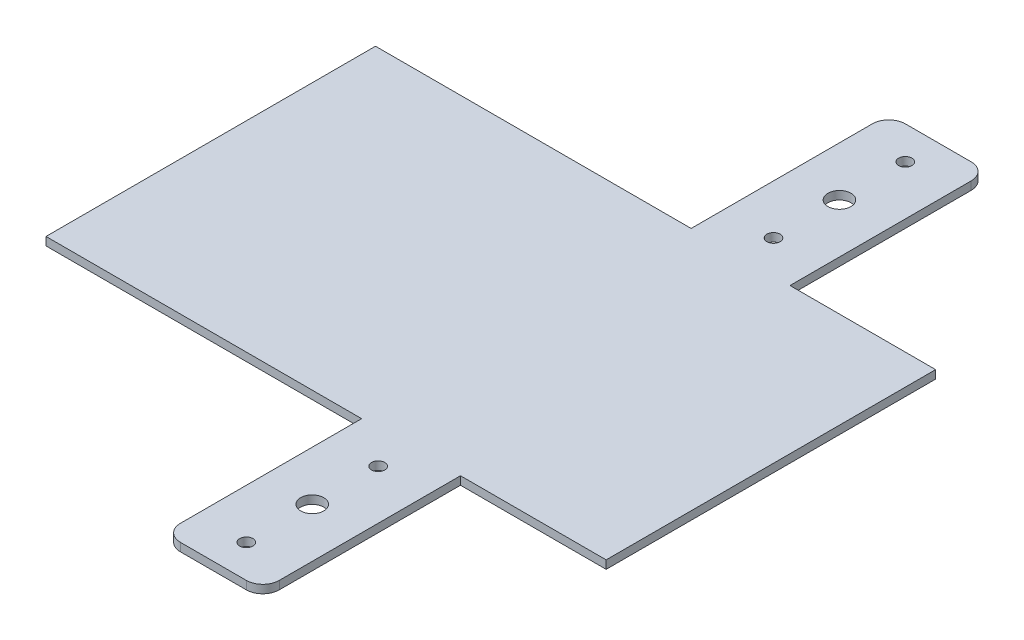
ISO-10303-21;
HEADER;
FILE_DESCRIPTION(('STEP AP214'),'2;1');
FILE_NAME('part.step','',(''),(''),'','','');
FILE_SCHEMA(('AUTOMOTIVE_DESIGN { 1 0 10303 214 1 1 1 1 }'));
ENDSEC;
DATA;
#1=APPLICATION_CONTEXT('core data for automotive mechanical design processes');
#2=APPLICATION_PROTOCOL_DEFINITION('international standard','automotive_design',2000,#1);
#3=PRODUCT_CONTEXT('',#1,'mechanical');
#4=PRODUCT('Part','Part','',(#3));
#5=PRODUCT_RELATED_PRODUCT_CATEGORY('part','',(#4));
#6=PRODUCT_DEFINITION_FORMATION('','',#4);
#7=PRODUCT_DEFINITION_CONTEXT('part definition',#1,'design');
#8=PRODUCT_DEFINITION('design','',#6,#7);
#9=PRODUCT_DEFINITION_SHAPE('','',#8);
#10=(LENGTH_UNIT() NAMED_UNIT(*) SI_UNIT(.MILLI.,.METRE.));
#11=(NAMED_UNIT(*) PLANE_ANGLE_UNIT() SI_UNIT($,.RADIAN.));
#12=(NAMED_UNIT(*) SI_UNIT($,.STERADIAN.) SOLID_ANGLE_UNIT());
#13=UNCERTAINTY_MEASURE_WITH_UNIT(LENGTH_MEASURE(1.E-05),#10,'distance_accuracy_value','');
#14=(GEOMETRIC_REPRESENTATION_CONTEXT(3) GLOBAL_UNCERTAINTY_ASSIGNED_CONTEXT((#13)) GLOBAL_UNIT_ASSIGNED_CONTEXT((#10,
#11,#12)) REPRESENTATION_CONTEXT('',''));
#15=CARTESIAN_POINT('',(0.,0.,0.));
#16=DIRECTION('',(0.,0.,1.));
#17=DIRECTION('',(1.,0.,0.));
#18=AXIS2_PLACEMENT_3D('',#15,#16,#17);
#19=CARTESIAN_POINT('',(-499.708642175763,5.,-105.631578947368));
#20=DIRECTION('',(0.,1.,0.));
#21=DIRECTION('',(0.,0.,1.));
#22=AXIS2_PLACEMENT_3D('',#19,#20,#21);
#23=PLANE('',#22);
#24=CARTESIAN_POINT('',(-479.708642175763,5.,-115.631578947368));
#25=DIRECTION('',(0.,1.,0.));
#26=DIRECTION('',(0.,0.,1.));
#27=AXIS2_PLACEMENT_3D('',#24,#25,#26);
#28=CIRCLE('',#27,3.99999999999999);
#29=CARTESIAN_POINT('',(-479.708642175763,5.,-111.631578947368));
#30=VERTEX_POINT('',#29);
#31=EDGE_CURVE('E412',#30,#30,#28,.T.);
#32=ORIENTED_EDGE('',*,*,#31,.F.);
#33=EDGE_LOOP('',(#32));
#34=FACE_BOUND('',#33,.T.);
#35=CARTESIAN_POINT('',(-479.708642175763,5.,-515.631578947368));
#36=DIRECTION('',(0.,1.,0.));
#37=DIRECTION('',(0.,0.,-1.));
#38=AXIS2_PLACEMENT_3D('',#35,#36,#37);
#39=CIRCLE('',#38,3.99999999999999);
#40=CARTESIAN_POINT('',(-479.708642175763,5.,-519.631578947368));
#41=VERTEX_POINT('',#40);
#42=EDGE_CURVE('E404',#41,#41,#39,.T.);
#43=ORIENTED_EDGE('',*,*,#42,.F.);
#44=EDGE_LOOP('',(#43));
#45=FACE_BOUND('',#44,.T.);
#46=CARTESIAN_POINT('',(-479.708642175763,5.,-435.631578947368));
#47=DIRECTION('',(0.,1.,0.));
#48=DIRECTION('',(0.,0.,-1.));
#49=AXIS2_PLACEMENT_3D('',#46,#47,#48);
#50=CIRCLE('',#49,3.99999999999999);
#51=CARTESIAN_POINT('',(-479.708642175763,5.,-439.631578947368));
#52=VERTEX_POINT('',#51);
#53=EDGE_CURVE('E399',#52,#52,#50,.T.);
#54=ORIENTED_EDGE('',*,*,#53,.F.);
#55=EDGE_LOOP('',(#54));
#56=FACE_BOUND('',#55,.T.);
#57=CARTESIAN_POINT('',(-479.708642175763,5.,-195.631578947368));
#58=DIRECTION('',(0.,1.,0.));
#59=DIRECTION('',(0.,0.,1.));
#60=AXIS2_PLACEMENT_3D('',#57,#58,#59);
#61=CIRCLE('',#60,3.99999999999999);
#62=CARTESIAN_POINT('',(-479.708642175763,5.,-191.631578947368));
#63=VERTEX_POINT('',#62);
#64=EDGE_CURVE('E411',#63,#63,#61,.T.);
#65=ORIENTED_EDGE('',*,*,#64,.F.);
#66=EDGE_LOOP('',(#65));
#67=FACE_BOUND('',#66,.T.);
#68=CARTESIAN_POINT('',(-479.708642175763,5.,-475.631578947368));
#69=DIRECTION('',(0.,1.,0.));
#70=DIRECTION('',(0.,0.,1.));
#71=AXIS2_PLACEMENT_3D('',#68,#69,#70);
#72=CIRCLE('',#71,6.99999999999999);
#73=CARTESIAN_POINT('',(-479.708642175763,5.,-468.631578947368));
#74=VERTEX_POINT('',#73);
#75=EDGE_CURVE('E196',#74,#74,#72,.T.);
#76=ORIENTED_EDGE('',*,*,#75,.F.);
#77=EDGE_LOOP('',(#76));
#78=FACE_BOUND('',#77,.T.);
#79=DIRECTION('',(0.,0.,1.));
#80=VECTOR('',#79,1.);
#81=CARTESIAN_POINT('',(-701.29647542446,5.,-415.631578947368));
#82=LINE('',#81,#80);
#83=CARTESIAN_POINT('',(-701.29647542446,5.,-415.631578947368));
#84=VERTEX_POINT('',#83);
#85=CARTESIAN_POINT('',(-701.29647542446,5.,-215.631578947368));
#86=VERTEX_POINT('',#85);
#87=EDGE_CURVE('E238',#84,#86,#82,.T.);
#88=ORIENTED_EDGE('',*,*,#87,.T.);
#89=DIRECTION('',(1.,0.,0.));
#90=VECTOR('',#89,1.);
#91=CARTESIAN_POINT('',(-701.29647542446,5.,-215.631578947368));
#92=LINE('',#91,#90);
#93=CARTESIAN_POINT('',(-509.708642175763,5.,-215.631578947368));
#94=VERTEX_POINT('',#93);
#95=EDGE_CURVE('E126',#86,#94,#92,.T.);
#96=ORIENTED_EDGE('',*,*,#95,.T.);
#97=DIRECTION('',(0.,0.,1.));
#98=VECTOR('',#97,1.);
#99=CARTESIAN_POINT('',(-509.708642175763,5.,-215.631578947368));
#100=LINE('',#99,#98);
#101=CARTESIAN_POINT('',(-509.708642175763,5.,-105.631578947368));
#102=VERTEX_POINT('',#101);
#103=EDGE_CURVE('E291',#94,#102,#100,.T.);
#104=ORIENTED_EDGE('',*,*,#103,.T.);
#105=CARTESIAN_POINT('',(-499.708642175763,5.,-105.631578947368));
#106=DIRECTION('',(0.,1.,0.));
#107=DIRECTION('',(0.,0.,1.));
#108=AXIS2_PLACEMENT_3D('',#105,#106,#107);
#109=CIRCLE('',#108,10.);
#110=CARTESIAN_POINT('',(-499.708642175763,5.,-95.6315789473683));
#111=VERTEX_POINT('',#110);
#112=EDGE_CURVE('E311',#102,#111,#109,.T.);
#113=ORIENTED_EDGE('',*,*,#112,.T.);
#114=DIRECTION('',(1.,0.,0.));
#115=VECTOR('',#114,1.);
#116=CARTESIAN_POINT('',(-499.708642175763,5.,-95.6315789473683));
#117=LINE('',#116,#115);
#118=CARTESIAN_POINT('',(-459.708642175763,5.,-95.6315789473684));
#119=VERTEX_POINT('',#118);
#120=EDGE_CURVE('E307',#111,#119,#117,.T.);
#121=ORIENTED_EDGE('',*,*,#120,.T.);
#122=CARTESIAN_POINT('',(-459.708642175763,5.,-105.631578947368));
#123=DIRECTION('',(0.,1.,0.));
#124=DIRECTION('',(0.,0.,1.));
#125=AXIS2_PLACEMENT_3D('',#122,#123,#124);
#126=CIRCLE('',#125,10.);
#127=CARTESIAN_POINT('',(-449.708642175763,5.,-105.631578947368));
#128=VERTEX_POINT('',#127);
#129=EDGE_CURVE('E310',#119,#128,#126,.T.);
#130=ORIENTED_EDGE('',*,*,#129,.T.);
#131=DIRECTION('',(0.,0.,-1.));
#132=VECTOR('',#131,1.);
#133=CARTESIAN_POINT('',(-449.708642175763,5.,-215.631578947368));
#134=LINE('',#133,#132);
#135=CARTESIAN_POINT('',(-449.708642175763,5.,-215.631578947368));
#136=VERTEX_POINT('',#135);
#137=EDGE_CURVE('E315',#128,#136,#134,.T.);
#138=ORIENTED_EDGE('',*,*,#137,.T.);
#139=DIRECTION('',(1.,0.,0.));
#140=VECTOR('',#139,1.);
#141=CARTESIAN_POINT('',(-449.708642175763,5.,-215.631578947368));
#142=LINE('',#141,#140);
#143=CARTESIAN_POINT('',(-361.29647542446,5.,-215.631578947368));
#144=VERTEX_POINT('',#143);
#145=EDGE_CURVE('E322',#136,#144,#142,.T.);
#146=ORIENTED_EDGE('',*,*,#145,.T.);
#147=DIRECTION('',(0.,0.,-1.));
#148=VECTOR('',#147,1.);
#149=CARTESIAN_POINT('',(-361.29647542446,5.,-415.631578947368));
#150=LINE('',#149,#148);
#151=CARTESIAN_POINT('',(-361.29647542446,5.,-415.631578947368));
#152=VERTEX_POINT('',#151);
#153=EDGE_CURVE('E325',#144,#152,#150,.T.);
#154=ORIENTED_EDGE('',*,*,#153,.T.);
#155=DIRECTION('',(-1.,0.,0.));
#156=VECTOR('',#155,1.);
#157=CARTESIAN_POINT('',(-449.708642175763,5.,-415.631578947368));
#158=LINE('',#157,#156);
#159=CARTESIAN_POINT('',(-449.708642175763,5.,-415.631578947368));
#160=VERTEX_POINT('',#159);
#161=EDGE_CURVE('E328',#152,#160,#158,.T.);
#162=ORIENTED_EDGE('',*,*,#161,.T.);
#163=DIRECTION('',(0.,0.,-1.));
#164=VECTOR('',#163,1.);
#165=CARTESIAN_POINT('',(-449.708642175763,5.,-415.631578947368));
#166=LINE('',#165,#164);
#167=CARTESIAN_POINT('',(-449.708642175763,5.,-525.631578947368));
#168=VERTEX_POINT('',#167);
#169=EDGE_CURVE('E331',#160,#168,#166,.T.);
#170=ORIENTED_EDGE('',*,*,#169,.T.);
#171=CARTESIAN_POINT('',(-459.708642175763,5.,-525.631578947368));
#172=DIRECTION('',(0.,1.,0.));
#173=DIRECTION('',(0.,0.,-1.));
#174=AXIS2_PLACEMENT_3D('',#171,#172,#173);
#175=CIRCLE('',#174,10.);
#176=CARTESIAN_POINT('',(-459.708642175763,5.,-535.631578947368));
#177=VERTEX_POINT('',#176);
#178=EDGE_CURVE('E334',#168,#177,#175,.T.);
#179=ORIENTED_EDGE('',*,*,#178,.T.);
#180=DIRECTION('',(-1.,0.,0.));
#181=VECTOR('',#180,1.);
#182=CARTESIAN_POINT('',(-499.708642175763,5.,-535.631578947368));
#183=LINE('',#182,#181);
#184=CARTESIAN_POINT('',(-499.708642175763,5.,-535.631578947368));
#185=VERTEX_POINT('',#184);
#186=EDGE_CURVE('E169',#177,#185,#183,.T.);
#187=ORIENTED_EDGE('',*,*,#186,.T.);
#188=CARTESIAN_POINT('',(-499.708642175763,5.,-525.631578947368));
#189=DIRECTION('',(0.,1.,0.));
#190=DIRECTION('',(0.,0.,-1.));
#191=AXIS2_PLACEMENT_3D('',#188,#189,#190);
#192=CIRCLE('',#191,10.);
#193=CARTESIAN_POINT('',(-509.708642175763,5.,-525.631578947368));
#194=VERTEX_POINT('',#193);
#195=EDGE_CURVE('E163',#185,#194,#192,.T.);
#196=ORIENTED_EDGE('',*,*,#195,.T.);
#197=DIRECTION('',(0.,0.,1.));
#198=VECTOR('',#197,1.);
#199=CARTESIAN_POINT('',(-509.708642175763,5.,-415.631578947368));
#200=LINE('',#199,#198);
#201=CARTESIAN_POINT('',(-509.708642175763,5.,-415.631578947368));
#202=VERTEX_POINT('',#201);
#203=EDGE_CURVE('E167',#194,#202,#200,.T.);
#204=ORIENTED_EDGE('',*,*,#203,.T.);
#205=DIRECTION('',(-1.,0.,0.));
#206=VECTOR('',#205,1.);
#207=CARTESIAN_POINT('',(-701.29647542446,5.,-415.631578947368));
#208=LINE('',#207,#206);
#209=EDGE_CURVE('E59',#202,#84,#208,.T.);
#210=ORIENTED_EDGE('',*,*,#209,.T.);
#211=EDGE_LOOP('',(#88,#96,#104,#113,#121,#130,#138,#146,#154,#162,#170,#179,#187,#196,#204,#210));
#212=FACE_BOUND('',#211,.T.);
#213=CARTESIAN_POINT('',(-479.708642175763,5.,-155.631578947368));
#214=DIRECTION('',(0.,1.,0.));
#215=DIRECTION('',(0.,0.,1.));
#216=AXIS2_PLACEMENT_3D('',#213,#214,#215);
#217=CIRCLE('',#216,6.99999999999999);
#218=CARTESIAN_POINT('',(-479.708642175763,5.,-148.631578947368));
#219=VERTEX_POINT('',#218);
#220=EDGE_CURVE('E431',#219,#219,#217,.T.);
#221=ORIENTED_EDGE('',*,*,#220,.F.);
#222=EDGE_LOOP('',(#221));
#223=FACE_BOUND('',#222,.T.);
#224=ADVANCED_FACE('F41',(#34,#45,#56,#67,#78,#212,#223),#23,.T.);
#225=CARTESIAN_POINT('',(-499.708642175763,0.,-105.631578947368));
#226=DIRECTION('',(0.,1.,0.));
#227=DIRECTION('',(0.,0.,1.));
#228=AXIS2_PLACEMENT_3D('',#225,#226,#227);
#229=PLANE('',#228);
#230=CARTESIAN_POINT('',(-479.708642175763,0.,-115.631578947368));
#231=DIRECTION('',(0.,1.,0.));
#232=DIRECTION('',(0.,0.,1.));
#233=AXIS2_PLACEMENT_3D('',#230,#231,#232);
#234=CIRCLE('',#233,3.99999999999999);
#235=CARTESIAN_POINT('',(-479.708642175763,0.,-111.631578947368));
#236=VERTEX_POINT('',#235);
#237=EDGE_CURVE('E407',#236,#236,#234,.T.);
#238=ORIENTED_EDGE('',*,*,#237,.T.);
#239=EDGE_LOOP('',(#238));
#240=FACE_BOUND('',#239,.T.);
#241=CARTESIAN_POINT('',(-479.708642175763,0.,-515.631578947368));
#242=DIRECTION('',(0.,1.,0.));
#243=DIRECTION('',(0.,0.,-1.));
#244=AXIS2_PLACEMENT_3D('',#241,#242,#243);
#245=CIRCLE('',#244,3.99999999999999);
#246=CARTESIAN_POINT('',(-479.708642175763,0.,-519.631578947368));
#247=VERTEX_POINT('',#246);
#248=EDGE_CURVE('E416',#247,#247,#245,.T.);
#249=ORIENTED_EDGE('',*,*,#248,.T.);
#250=EDGE_LOOP('',(#249));
#251=FACE_BOUND('',#250,.T.);
#252=CARTESIAN_POINT('',(-479.708642175763,0.,-435.631578947368));
#253=DIRECTION('',(0.,1.,0.));
#254=DIRECTION('',(0.,0.,-1.));
#255=AXIS2_PLACEMENT_3D('',#252,#253,#254);
#256=CIRCLE('',#255,3.99999999999999);
#257=CARTESIAN_POINT('',(-479.708642175763,0.,-439.631578947368));
#258=VERTEX_POINT('',#257);
#259=EDGE_CURVE('E396',#258,#258,#256,.T.);
#260=ORIENTED_EDGE('',*,*,#259,.T.);
#261=EDGE_LOOP('',(#260));
#262=FACE_BOUND('',#261,.T.);
#263=CARTESIAN_POINT('',(-479.708642175763,0.,-195.631578947368));
#264=DIRECTION('',(0.,1.,0.));
#265=DIRECTION('',(0.,0.,1.));
#266=AXIS2_PLACEMENT_3D('',#263,#264,#265);
#267=CIRCLE('',#266,3.99999999999999);
#268=CARTESIAN_POINT('',(-479.708642175763,0.,-191.631578947368));
#269=VERTEX_POINT('',#268);
#270=EDGE_CURVE('E423',#269,#269,#267,.T.);
#271=ORIENTED_EDGE('',*,*,#270,.T.);
#272=EDGE_LOOP('',(#271));
#273=FACE_BOUND('',#272,.T.);
#274=DIRECTION('',(0.,0.,1.));
#275=VECTOR('',#274,1.);
#276=CARTESIAN_POINT('',(-701.29647542446,0.,-415.631578947368));
#277=LINE('',#276,#275);
#278=CARTESIAN_POINT('',(-701.29647542446,0.,-415.631578947368));
#279=VERTEX_POINT('',#278);
#280=CARTESIAN_POINT('',(-701.29647542446,0.,-215.631578947368));
#281=VERTEX_POINT('',#280);
#282=EDGE_CURVE('E191',#279,#281,#277,.T.);
#283=ORIENTED_EDGE('',*,*,#282,.F.);
#284=DIRECTION('',(-1.,0.,0.));
#285=VECTOR('',#284,1.);
#286=CARTESIAN_POINT('',(-701.29647542446,0.,-415.631578947368));
#287=LINE('',#286,#285);
#288=CARTESIAN_POINT('',(-509.708642175763,0.,-415.631578947368));
#289=VERTEX_POINT('',#288);
#290=EDGE_CURVE('E118',#289,#279,#287,.T.);
#291=ORIENTED_EDGE('',*,*,#290,.F.);
#292=DIRECTION('',(0.,0.,1.));
#293=VECTOR('',#292,1.);
#294=CARTESIAN_POINT('',(-509.708642175763,0.,-415.631578947368));
#295=LINE('',#294,#293);
#296=CARTESIAN_POINT('',(-509.708642175763,0.,-525.631578947368));
#297=VERTEX_POINT('',#296);
#298=EDGE_CURVE('E112',#297,#289,#295,.T.);
#299=ORIENTED_EDGE('',*,*,#298,.F.);
#300=CARTESIAN_POINT('',(-499.708642175763,0.,-525.631578947368));
#301=DIRECTION('',(0.,1.,0.));
#302=DIRECTION('',(0.,0.,-1.));
#303=AXIS2_PLACEMENT_3D('',#300,#301,#302);
#304=CIRCLE('',#303,10.);
#305=CARTESIAN_POINT('',(-499.708642175763,0.,-535.631578947368));
#306=VERTEX_POINT('',#305);
#307=EDGE_CURVE('E178',#306,#297,#304,.T.);
#308=ORIENTED_EDGE('',*,*,#307,.F.);
#309=DIRECTION('',(-1.,0.,0.));
#310=VECTOR('',#309,1.);
#311=CARTESIAN_POINT('',(-499.708642175763,0.,-535.631578947368));
#312=LINE('',#311,#310);
#313=CARTESIAN_POINT('',(-459.708642175763,0.,-535.631578947368));
#314=VERTEX_POINT('',#313);
#315=EDGE_CURVE('E229',#314,#306,#312,.T.);
#316=ORIENTED_EDGE('',*,*,#315,.F.);
#317=CARTESIAN_POINT('',(-459.708642175763,0.,-525.631578947368));
#318=DIRECTION('',(0.,1.,0.));
#319=DIRECTION('',(0.,0.,-1.));
#320=AXIS2_PLACEMENT_3D('',#317,#318,#319);
#321=CIRCLE('',#320,10.);
#322=CARTESIAN_POINT('',(-449.708642175763,0.,-525.631578947368));
#323=VERTEX_POINT('',#322);
#324=EDGE_CURVE('E226',#323,#314,#321,.T.);
#325=ORIENTED_EDGE('',*,*,#324,.F.);
#326=DIRECTION('',(0.,0.,-1.));
#327=VECTOR('',#326,1.);
#328=CARTESIAN_POINT('',(-449.708642175763,0.,-415.631578947368));
#329=LINE('',#328,#327);
#330=CARTESIAN_POINT('',(-449.708642175763,0.,-415.631578947368));
#331=VERTEX_POINT('',#330);
#332=EDGE_CURVE('E223',#331,#323,#329,.T.);
#333=ORIENTED_EDGE('',*,*,#332,.F.);
#334=DIRECTION('',(-1.,0.,0.));
#335=VECTOR('',#334,1.);
#336=CARTESIAN_POINT('',(-449.708642175763,0.,-415.631578947368));
#337=LINE('',#336,#335);
#338=CARTESIAN_POINT('',(-361.29647542446,0.,-415.631578947368));
#339=VERTEX_POINT('',#338);
#340=EDGE_CURVE('E220',#339,#331,#337,.T.);
#341=ORIENTED_EDGE('',*,*,#340,.F.);
#342=DIRECTION('',(0.,0.,-1.));
#343=VECTOR('',#342,1.);
#344=CARTESIAN_POINT('',(-361.29647542446,0.,-415.631578947368));
#345=LINE('',#344,#343);
#346=CARTESIAN_POINT('',(-361.29647542446,0.,-215.631578947368));
#347=VERTEX_POINT('',#346);
#348=EDGE_CURVE('E217',#347,#339,#345,.T.);
#349=ORIENTED_EDGE('',*,*,#348,.F.);
#350=DIRECTION('',(1.,0.,0.));
#351=VECTOR('',#350,1.);
#352=CARTESIAN_POINT('',(-449.708642175763,0.,-215.631578947368));
#353=LINE('',#352,#351);
#354=CARTESIAN_POINT('',(-449.708642175763,0.,-215.631578947368));
#355=VERTEX_POINT('',#354);
#356=EDGE_CURVE('E214',#355,#347,#353,.T.);
#357=ORIENTED_EDGE('',*,*,#356,.F.);
#358=DIRECTION('',(0.,0.,-1.));
#359=VECTOR('',#358,1.);
#360=CARTESIAN_POINT('',(-449.708642175763,0.,-215.631578947368));
#361=LINE('',#360,#359);
#362=CARTESIAN_POINT('',(-449.708642175763,0.,-105.631578947368));
#363=VERTEX_POINT('',#362);
#364=EDGE_CURVE('E211',#363,#355,#361,.T.);
#365=ORIENTED_EDGE('',*,*,#364,.F.);
#366=CARTESIAN_POINT('',(-459.708642175763,0.,-105.631578947368));
#367=DIRECTION('',(0.,1.,0.));
#368=DIRECTION('',(0.,0.,1.));
#369=AXIS2_PLACEMENT_3D('',#366,#367,#368);
#370=CIRCLE('',#369,10.);
#371=CARTESIAN_POINT('',(-459.708642175763,0.,-95.6315789473684));
#372=VERTEX_POINT('',#371);
#373=EDGE_CURVE('E208',#372,#363,#370,.T.);
#374=ORIENTED_EDGE('',*,*,#373,.F.);
#375=DIRECTION('',(1.,0.,0.));
#376=VECTOR('',#375,1.);
#377=CARTESIAN_POINT('',(-499.708642175763,0.,-95.6315789473683));
#378=LINE('',#377,#376);
#379=CARTESIAN_POINT('',(-499.708642175763,0.,-95.6315789473683));
#380=VERTEX_POINT('',#379);
#381=EDGE_CURVE('E205',#380,#372,#378,.T.);
#382=ORIENTED_EDGE('',*,*,#381,.F.);
#383=CARTESIAN_POINT('',(-499.708642175763,0.,-105.631578947368));
#384=DIRECTION('',(0.,1.,0.));
#385=DIRECTION('',(0.,0.,1.));
#386=AXIS2_PLACEMENT_3D('',#383,#384,#385);
#387=CIRCLE('',#386,10.);
#388=CARTESIAN_POINT('',(-509.708642175763,0.,-105.631578947368));
#389=VERTEX_POINT('',#388);
#390=EDGE_CURVE('E202',#389,#380,#387,.T.);
#391=ORIENTED_EDGE('',*,*,#390,.F.);
#392=DIRECTION('',(0.,0.,1.));
#393=VECTOR('',#392,1.);
#394=CARTESIAN_POINT('',(-509.708642175763,0.,-215.631578947368));
#395=LINE('',#394,#393);
#396=CARTESIAN_POINT('',(-509.708642175763,0.,-215.631578947368));
#397=VERTEX_POINT('',#396);
#398=EDGE_CURVE('E199',#397,#389,#395,.T.);
#399=ORIENTED_EDGE('',*,*,#398,.F.);
#400=DIRECTION('',(1.,0.,0.));
#401=VECTOR('',#400,1.);
#402=CARTESIAN_POINT('',(-701.29647542446,0.,-215.631578947368));
#403=LINE('',#402,#401);
#404=EDGE_CURVE('E195',#281,#397,#403,.T.);
#405=ORIENTED_EDGE('',*,*,#404,.F.);
#406=EDGE_LOOP('',(#283,#291,#299,#308,#316,#325,#333,#341,#349,#357,#365,#374,#382,#391,#399,#405));
#407=FACE_BOUND('',#406,.T.);
#408=CARTESIAN_POINT('',(-479.708642175763,0.,-475.631578947368));
#409=DIRECTION('',(0.,1.,0.));
#410=DIRECTION('',(0.,0.,1.));
#411=AXIS2_PLACEMENT_3D('',#408,#409,#410);
#412=CIRCLE('',#411,6.99999999999999);
#413=CARTESIAN_POINT('',(-479.708642175763,0.,-468.631578947368));
#414=VERTEX_POINT('',#413);
#415=EDGE_CURVE('E435',#414,#414,#412,.T.);
#416=ORIENTED_EDGE('',*,*,#415,.T.);
#417=EDGE_LOOP('',(#416));
#418=FACE_BOUND('',#417,.T.);
#419=CARTESIAN_POINT('',(-479.708642175763,0.,-155.631578947368));
#420=DIRECTION('',(0.,1.,0.));
#421=DIRECTION('',(0.,0.,1.));
#422=AXIS2_PLACEMENT_3D('',#419,#420,#421);
#423=CIRCLE('',#422,6.99999999999999);
#424=CARTESIAN_POINT('',(-479.708642175763,0.,-148.631578947368));
#425=VERTEX_POINT('',#424);
#426=EDGE_CURVE('E427',#425,#425,#423,.T.);
#427=ORIENTED_EDGE('',*,*,#426,.T.);
#428=EDGE_LOOP('',(#427));
#429=FACE_BOUND('',#428,.T.);
#430=ADVANCED_FACE('F295',(#240,#251,#262,#273,#407,#418,#429),#229,.F.);
#431=CARTESIAN_POINT('',(-701.29647542446,5.,-415.631578947368));
#432=DIRECTION('',(1.,0.,0.));
#433=DIRECTION('',(0.,0.,-1.));
#434=AXIS2_PLACEMENT_3D('',#431,#432,#433);
#435=PLANE('',#434);
#436=ORIENTED_EDGE('',*,*,#282,.T.);
#437=DIRECTION('',(0.,-1.,0.));
#438=VECTOR('',#437,1.);
#439=CARTESIAN_POINT('',(-701.29647542446,5.,-215.631578947368));
#440=LINE('',#439,#438);
#441=EDGE_CURVE('E11',#86,#281,#440,.T.);
#442=ORIENTED_EDGE('',*,*,#441,.F.);
#443=ORIENTED_EDGE('',*,*,#87,.F.);
#444=DIRECTION('',(0.,-1.,0.));
#445=VECTOR('',#444,1.);
#446=CARTESIAN_POINT('',(-701.29647542446,5.,-415.631578947368));
#447=LINE('',#446,#445);
#448=EDGE_CURVE('E187',#84,#279,#447,.T.);
#449=ORIENTED_EDGE('',*,*,#448,.T.);
#450=EDGE_LOOP('',(#436,#442,#443,#449));
#451=FACE_BOUND('',#450,.T.);
#452=ADVANCED_FACE('F43',(#451),#435,.F.);
#453=CARTESIAN_POINT('',(-701.29647542446,5.,-215.631578947368));
#454=DIRECTION('',(0.,0.,-1.));
#455=DIRECTION('',(-1.,0.,0.));
#456=AXIS2_PLACEMENT_3D('',#453,#454,#455);
#457=PLANE('',#456);
#458=ORIENTED_EDGE('',*,*,#404,.T.);
#459=DIRECTION('',(0.,-1.,0.));
#460=VECTOR('',#459,1.);
#461=CARTESIAN_POINT('',(-509.708642175763,5.,-215.631578947368));
#462=LINE('',#461,#460);
#463=EDGE_CURVE('E51',#94,#397,#462,.T.);
#464=ORIENTED_EDGE('',*,*,#463,.F.);
#465=ORIENTED_EDGE('',*,*,#95,.F.);
#466=ORIENTED_EDGE('',*,*,#441,.T.);
#467=EDGE_LOOP('',(#458,#464,#465,#466));
#468=FACE_BOUND('',#467,.T.);
#469=ADVANCED_FACE('F606',(#468),#457,.F.);
#470=CARTESIAN_POINT('',(-509.708642175763,5.,-215.631578947368));
#471=DIRECTION('',(1.,0.,0.));
#472=DIRECTION('',(0.,0.,-1.));
#473=AXIS2_PLACEMENT_3D('',#470,#471,#472);
#474=PLANE('',#473);
#475=ORIENTED_EDGE('',*,*,#398,.T.);
#476=DIRECTION('',(0.,-1.,0.));
#477=VECTOR('',#476,1.);
#478=CARTESIAN_POINT('',(-509.708642175763,5.,-105.631578947368));
#479=LINE('',#478,#477);
#480=EDGE_CURVE('E281',#102,#389,#479,.T.);
#481=ORIENTED_EDGE('',*,*,#480,.F.);
#482=ORIENTED_EDGE('',*,*,#103,.F.);
#483=ORIENTED_EDGE('',*,*,#463,.T.);
#484=EDGE_LOOP('',(#475,#481,#482,#483));
#485=FACE_BOUND('',#484,.T.);
#486=ADVANCED_FACE('F289',(#485),#474,.F.);
#487=CARTESIAN_POINT('',(-499.708642175763,5.,-105.631578947368));
#488=DIRECTION('',(0.,-1.,0.));
#489=DIRECTION('',(0.,0.,-1.));
#490=AXIS2_PLACEMENT_3D('',#487,#488,#489);
#491=CYLINDRICAL_SURFACE('',#490,10.);
#492=ORIENTED_EDGE('',*,*,#390,.T.);
#493=DIRECTION('',(0.,-1.,0.));
#494=VECTOR('',#493,1.);
#495=CARTESIAN_POINT('',(-499.708642175763,5.,-95.6315789473683));
#496=LINE('',#495,#494);
#497=EDGE_CURVE('E277',#111,#380,#496,.T.);
#498=ORIENTED_EDGE('',*,*,#497,.F.);
#499=ORIENTED_EDGE('',*,*,#112,.F.);
#500=ORIENTED_EDGE('',*,*,#480,.T.);
#501=EDGE_LOOP('',(#492,#498,#499,#500));
#502=FACE_BOUND('',#501,.T.);
#503=ADVANCED_FACE('F301',(#502),#491,.T.);
#504=CARTESIAN_POINT('',(-499.708642175763,5.,-95.6315789473683));
#505=DIRECTION('',(0.,0.,-1.));
#506=DIRECTION('',(-1.,0.,0.));
#507=AXIS2_PLACEMENT_3D('',#504,#505,#506);
#508=PLANE('',#507);
#509=ORIENTED_EDGE('',*,*,#381,.T.);
#510=DIRECTION('',(0.,-1.,0.));
#511=VECTOR('',#510,1.);
#512=CARTESIAN_POINT('',(-459.708642175763,5.,-95.6315789473684));
#513=LINE('',#512,#511);
#514=EDGE_CURVE('E273',#119,#372,#513,.T.);
#515=ORIENTED_EDGE('',*,*,#514,.F.);
#516=ORIENTED_EDGE('',*,*,#120,.F.);
#517=ORIENTED_EDGE('',*,*,#497,.T.);
#518=EDGE_LOOP('',(#509,#515,#516,#517));
#519=FACE_BOUND('',#518,.T.);
#520=ADVANCED_FACE('F305',(#519),#508,.F.);
#521=CARTESIAN_POINT('',(-459.708642175763,5.,-105.631578947368));
#522=DIRECTION('',(0.,-1.,0.));
#523=DIRECTION('',(0.,0.,-1.));
#524=AXIS2_PLACEMENT_3D('',#521,#522,#523);
#525=CYLINDRICAL_SURFACE('',#524,10.);
#526=ORIENTED_EDGE('',*,*,#373,.T.);
#527=DIRECTION('',(0.,-1.,0.));
#528=VECTOR('',#527,1.);
#529=CARTESIAN_POINT('',(-449.708642175763,5.,-105.631578947368));
#530=LINE('',#529,#528);
#531=EDGE_CURVE('E269',#128,#363,#530,.T.);
#532=ORIENTED_EDGE('',*,*,#531,.F.);
#533=ORIENTED_EDGE('',*,*,#129,.F.);
#534=ORIENTED_EDGE('',*,*,#514,.T.);
#535=EDGE_LOOP('',(#526,#532,#533,#534));
#536=FACE_BOUND('',#535,.T.);
#537=ADVANCED_FACE('F575',(#536),#525,.T.);
#538=CARTESIAN_POINT('',(-449.708642175763,5.,-215.631578947368));
#539=DIRECTION('',(-1.,0.,0.));
#540=DIRECTION('',(0.,0.,1.));
#541=AXIS2_PLACEMENT_3D('',#538,#539,#540);
#542=PLANE('',#541);
#543=ORIENTED_EDGE('',*,*,#364,.T.);
#544=DIRECTION('',(0.,-1.,0.));
#545=VECTOR('',#544,1.);
#546=CARTESIAN_POINT('',(-449.708642175763,5.,-215.631578947368));
#547=LINE('',#546,#545);
#548=EDGE_CURVE('E265',#136,#355,#547,.T.);
#549=ORIENTED_EDGE('',*,*,#548,.F.);
#550=ORIENTED_EDGE('',*,*,#137,.F.);
#551=ORIENTED_EDGE('',*,*,#531,.T.);
#552=EDGE_LOOP('',(#543,#549,#550,#551));
#553=FACE_BOUND('',#552,.T.);
#554=ADVANCED_FACE('F566',(#553),#542,.F.);
#555=CARTESIAN_POINT('',(-449.708642175763,5.,-215.631578947368));
#556=DIRECTION('',(0.,0.,-1.));
#557=DIRECTION('',(-1.,0.,0.));
#558=AXIS2_PLACEMENT_3D('',#555,#556,#557);
#559=PLANE('',#558);
#560=ORIENTED_EDGE('',*,*,#356,.T.);
#561=DIRECTION('',(0.,-1.,0.));
#562=VECTOR('',#561,1.);
#563=CARTESIAN_POINT('',(-361.29647542446,5.,-215.631578947368));
#564=LINE('',#563,#562);
#565=EDGE_CURVE('E261',#144,#347,#564,.T.);
#566=ORIENTED_EDGE('',*,*,#565,.F.);
#567=ORIENTED_EDGE('',*,*,#145,.F.);
#568=ORIENTED_EDGE('',*,*,#548,.T.);
#569=EDGE_LOOP('',(#560,#566,#567,#568));
#570=FACE_BOUND('',#569,.T.);
#571=ADVANCED_FACE('F557',(#570),#559,.F.);
#572=CARTESIAN_POINT('',(-361.29647542446,5.,-415.631578947368));
#573=DIRECTION('',(-1.,0.,0.));
#574=DIRECTION('',(0.,0.,1.));
#575=AXIS2_PLACEMENT_3D('',#572,#573,#574);
#576=PLANE('',#575);
#577=ORIENTED_EDGE('',*,*,#348,.T.);
#578=DIRECTION('',(0.,-1.,0.));
#579=VECTOR('',#578,1.);
#580=CARTESIAN_POINT('',(-361.29647542446,5.,-415.631578947368));
#581=LINE('',#580,#579);
#582=EDGE_CURVE('E257',#152,#339,#581,.T.);
#583=ORIENTED_EDGE('',*,*,#582,.F.);
#584=ORIENTED_EDGE('',*,*,#153,.F.);
#585=ORIENTED_EDGE('',*,*,#565,.T.);
#586=EDGE_LOOP('',(#577,#583,#584,#585));
#587=FACE_BOUND('',#586,.T.);
#588=ADVANCED_FACE('F548',(#587),#576,.F.);
#589=CARTESIAN_POINT('',(-449.708642175763,5.,-415.631578947368));
#590=DIRECTION('',(0.,0.,1.));
#591=DIRECTION('',(1.,0.,0.));
#592=AXIS2_PLACEMENT_3D('',#589,#590,#591);
#593=PLANE('',#592);
#594=ORIENTED_EDGE('',*,*,#340,.T.);
#595=DIRECTION('',(0.,-1.,0.));
#596=VECTOR('',#595,1.);
#597=CARTESIAN_POINT('',(-449.708642175763,5.,-415.631578947368));
#598=LINE('',#597,#596);
#599=EDGE_CURVE('E253',#160,#331,#598,.T.);
#600=ORIENTED_EDGE('',*,*,#599,.F.);
#601=ORIENTED_EDGE('',*,*,#161,.F.);
#602=ORIENTED_EDGE('',*,*,#582,.T.);
#603=EDGE_LOOP('',(#594,#600,#601,#602));
#604=FACE_BOUND('',#603,.T.);
#605=ADVANCED_FACE('F539',(#604),#593,.F.);
#606=CARTESIAN_POINT('',(-449.708642175763,5.,-415.631578947368));
#607=DIRECTION('',(-1.,0.,0.));
#608=DIRECTION('',(0.,0.,1.));
#609=AXIS2_PLACEMENT_3D('',#606,#607,#608);
#610=PLANE('',#609);
#611=ORIENTED_EDGE('',*,*,#332,.T.);
#612=DIRECTION('',(0.,-1.,0.));
#613=VECTOR('',#612,1.);
#614=CARTESIAN_POINT('',(-449.708642175763,5.,-525.631578947368));
#615=LINE('',#614,#613);
#616=EDGE_CURVE('E249',#168,#323,#615,.T.);
#617=ORIENTED_EDGE('',*,*,#616,.F.);
#618=ORIENTED_EDGE('',*,*,#169,.F.);
#619=ORIENTED_EDGE('',*,*,#599,.T.);
#620=EDGE_LOOP('',(#611,#617,#618,#619));
#621=FACE_BOUND('',#620,.T.);
#622=ADVANCED_FACE('F531',(#621),#610,.F.);
#623=CARTESIAN_POINT('',(-459.708642175763,5.,-525.631578947368));
#624=DIRECTION('',(0.,-1.,0.));
#625=DIRECTION('',(0.,0.,-1.));
#626=AXIS2_PLACEMENT_3D('',#623,#624,#625);
#627=CYLINDRICAL_SURFACE('',#626,10.);
#628=ORIENTED_EDGE('',*,*,#324,.T.);
#629=DIRECTION('',(0.,-1.,0.));
#630=VECTOR('',#629,1.);
#631=CARTESIAN_POINT('',(-459.708642175763,5.,-535.631578947368));
#632=LINE('',#631,#630);
#633=EDGE_CURVE('E245',#177,#314,#632,.T.);
#634=ORIENTED_EDGE('',*,*,#633,.F.);
#635=ORIENTED_EDGE('',*,*,#178,.F.);
#636=ORIENTED_EDGE('',*,*,#616,.T.);
#637=EDGE_LOOP('',(#628,#634,#635,#636));
#638=FACE_BOUND('',#637,.T.);
#639=ADVANCED_FACE('F342',(#638),#627,.T.);
#640=CARTESIAN_POINT('',(-499.708642175763,5.,-535.631578947368));
#641=DIRECTION('',(0.,0.,1.));
#642=DIRECTION('',(1.,0.,0.));
#643=AXIS2_PLACEMENT_3D('',#640,#641,#642);
#644=PLANE('',#643);
#645=ORIENTED_EDGE('',*,*,#315,.T.);
#646=DIRECTION('',(0.,-1.,0.));
#647=VECTOR('',#646,1.);
#648=CARTESIAN_POINT('',(-499.708642175763,5.,-535.631578947368));
#649=LINE('',#648,#647);
#650=EDGE_CURVE('E180',#185,#306,#649,.T.);
#651=ORIENTED_EDGE('',*,*,#650,.F.);
#652=ORIENTED_EDGE('',*,*,#186,.F.);
#653=ORIENTED_EDGE('',*,*,#633,.T.);
#654=EDGE_LOOP('',(#645,#651,#652,#653));
#655=FACE_BOUND('',#654,.T.);
#656=ADVANCED_FACE('F346',(#655),#644,.F.);
#657=CARTESIAN_POINT('',(-499.708642175763,5.,-525.631578947368));
#658=DIRECTION('',(0.,-1.,0.));
#659=DIRECTION('',(0.,0.,-1.));
#660=AXIS2_PLACEMENT_3D('',#657,#658,#659);
#661=CYLINDRICAL_SURFACE('',#660,10.);
#662=ORIENTED_EDGE('',*,*,#307,.T.);
#663=DIRECTION('',(0.,-1.,0.));
#664=VECTOR('',#663,1.);
#665=CARTESIAN_POINT('',(-509.708642175763,5.,-525.631578947368));
#666=LINE('',#665,#664);
#667=EDGE_CURVE('E175',#194,#297,#666,.T.);
#668=ORIENTED_EDGE('',*,*,#667,.F.);
#669=ORIENTED_EDGE('',*,*,#195,.F.);
#670=ORIENTED_EDGE('',*,*,#650,.T.);
#671=EDGE_LOOP('',(#662,#668,#669,#670));
#672=FACE_BOUND('',#671,.T.);
#673=ADVANCED_FACE('F176',(#672),#661,.T.);
#674=CARTESIAN_POINT('',(-509.708642175763,5.,-415.631578947368));
#675=DIRECTION('',(1.,0.,0.));
#676=DIRECTION('',(0.,0.,-1.));
#677=AXIS2_PLACEMENT_3D('',#674,#675,#676);
#678=PLANE('',#677);
#679=ORIENTED_EDGE('',*,*,#298,.T.);
#680=DIRECTION('',(0.,-1.,0.));
#681=VECTOR('',#680,1.);
#682=CARTESIAN_POINT('',(-509.708642175763,5.,-415.631578947368));
#683=LINE('',#682,#681);
#684=EDGE_CURVE('E181',#202,#289,#683,.T.);
#685=ORIENTED_EDGE('',*,*,#684,.F.);
#686=ORIENTED_EDGE('',*,*,#203,.F.);
#687=ORIENTED_EDGE('',*,*,#667,.T.);
#688=EDGE_LOOP('',(#679,#685,#686,#687));
#689=FACE_BOUND('',#688,.T.);
#690=ADVANCED_FACE('F183',(#689),#678,.F.);
#691=CARTESIAN_POINT('',(-701.29647542446,5.,-415.631578947368));
#692=DIRECTION('',(0.,0.,1.));
#693=DIRECTION('',(1.,0.,0.));
#694=AXIS2_PLACEMENT_3D('',#691,#692,#693);
#695=PLANE('',#694);
#696=ORIENTED_EDGE('',*,*,#290,.T.);
#697=ORIENTED_EDGE('',*,*,#448,.F.);
#698=ORIENTED_EDGE('',*,*,#209,.F.);
#699=ORIENTED_EDGE('',*,*,#684,.T.);
#700=EDGE_LOOP('',(#696,#697,#698,#699));
#701=FACE_BOUND('',#700,.T.);
#702=ADVANCED_FACE('F350',(#701),#695,.F.);
#703=CARTESIAN_POINT('',(-479.708642175763,5.,-475.631578947368));
#704=DIRECTION('',(0.,-1.,0.));
#705=DIRECTION('',(0.,0.,-1.));
#706=AXIS2_PLACEMENT_3D('',#703,#704,#705);
#707=CYLINDRICAL_SURFACE('',#706,6.99999999999999);
#708=ORIENTED_EDGE('',*,*,#75,.T.);
#709=EDGE_LOOP('',(#708));
#710=FACE_BOUND('',#709,.T.);
#711=ORIENTED_EDGE('',*,*,#415,.F.);
#712=EDGE_LOOP('',(#711));
#713=FACE_BOUND('',#712,.T.);
#714=ADVANCED_FACE('F352',(#710,#713),#707,.F.);
#715=CARTESIAN_POINT('',(-479.708642175763,5.,-155.631578947368));
#716=DIRECTION('',(0.,-1.,0.));
#717=DIRECTION('',(0.,0.,-1.));
#718=AXIS2_PLACEMENT_3D('',#715,#716,#717);
#719=CYLINDRICAL_SURFACE('',#718,6.99999999999999);
#720=ORIENTED_EDGE('',*,*,#220,.T.);
#721=EDGE_LOOP('',(#720));
#722=FACE_BOUND('',#721,.T.);
#723=ORIENTED_EDGE('',*,*,#426,.F.);
#724=EDGE_LOOP('',(#723));
#725=FACE_BOUND('',#724,.T.);
#726=ADVANCED_FACE('F358',(#722,#725),#719,.F.);
#727=CARTESIAN_POINT('',(-479.708642175763,0.,-195.631578947368));
#728=DIRECTION('',(0.,1.,0.));
#729=DIRECTION('',(0.,0.,1.));
#730=AXIS2_PLACEMENT_3D('',#727,#728,#729);
#731=CYLINDRICAL_SURFACE('',#730,3.99999999999999);
#732=ORIENTED_EDGE('',*,*,#270,.F.);
#733=EDGE_LOOP('',(#732));
#734=FACE_BOUND('',#733,.T.);
#735=ORIENTED_EDGE('',*,*,#64,.T.);
#736=EDGE_LOOP('',(#735));
#737=FACE_BOUND('',#736,.T.);
#738=ADVANCED_FACE('F375',(#734,#737),#731,.F.);
#739=CARTESIAN_POINT('',(-479.708642175763,0.,-435.631578947368));
#740=DIRECTION('',(0.,1.,0.));
#741=DIRECTION('',(0.,0.,1.));
#742=AXIS2_PLACEMENT_3D('',#739,#740,#741);
#743=CYLINDRICAL_SURFACE('',#742,3.99999999999999);
#744=ORIENTED_EDGE('',*,*,#259,.F.);
#745=EDGE_LOOP('',(#744));
#746=FACE_BOUND('',#745,.T.);
#747=ORIENTED_EDGE('',*,*,#53,.T.);
#748=EDGE_LOOP('',(#747));
#749=FACE_BOUND('',#748,.T.);
#750=ADVANCED_FACE('F379',(#746,#749),#743,.F.);
#751=CARTESIAN_POINT('',(-479.708642175763,0.,-515.631578947368));
#752=DIRECTION('',(0.,1.,0.));
#753=DIRECTION('',(0.,0.,1.));
#754=AXIS2_PLACEMENT_3D('',#751,#752,#753);
#755=CYLINDRICAL_SURFACE('',#754,3.99999999999999);
#756=ORIENTED_EDGE('',*,*,#248,.F.);
#757=EDGE_LOOP('',(#756));
#758=FACE_BOUND('',#757,.T.);
#759=ORIENTED_EDGE('',*,*,#42,.T.);
#760=EDGE_LOOP('',(#759));
#761=FACE_BOUND('',#760,.T.);
#762=ADVANCED_FACE('F381',(#758,#761),#755,.F.);
#763=CARTESIAN_POINT('',(-479.708642175763,0.,-115.631578947368));
#764=DIRECTION('',(0.,1.,0.));
#765=DIRECTION('',(0.,0.,1.));
#766=AXIS2_PLACEMENT_3D('',#763,#764,#765);
#767=CYLINDRICAL_SURFACE('',#766,3.99999999999999);
#768=ORIENTED_EDGE('',*,*,#237,.F.);
#769=EDGE_LOOP('',(#768));
#770=FACE_BOUND('',#769,.T.);
#771=ORIENTED_EDGE('',*,*,#31,.T.);
#772=EDGE_LOOP('',(#771));
#773=FACE_BOUND('',#772,.T.);
#774=ADVANCED_FACE('F384',(#770,#773),#767,.F.);
#775=CLOSED_SHELL('',(#224,#430,#452,#469,#486,#503,#520,#537,#554,#571,#588,#605,#622,#639,
#656,#673,#690,#702,#714,#726,#738,#750,#762,#774));
#776=MANIFOLD_SOLID_BREP('B2',#775);
#777=ADVANCED_BREP_SHAPE_REPRESENTATION('',(#18,#776),#14);
#778=SHAPE_DEFINITION_REPRESENTATION(#9,#777);
ENDSEC;
END-ISO-10303-21;
